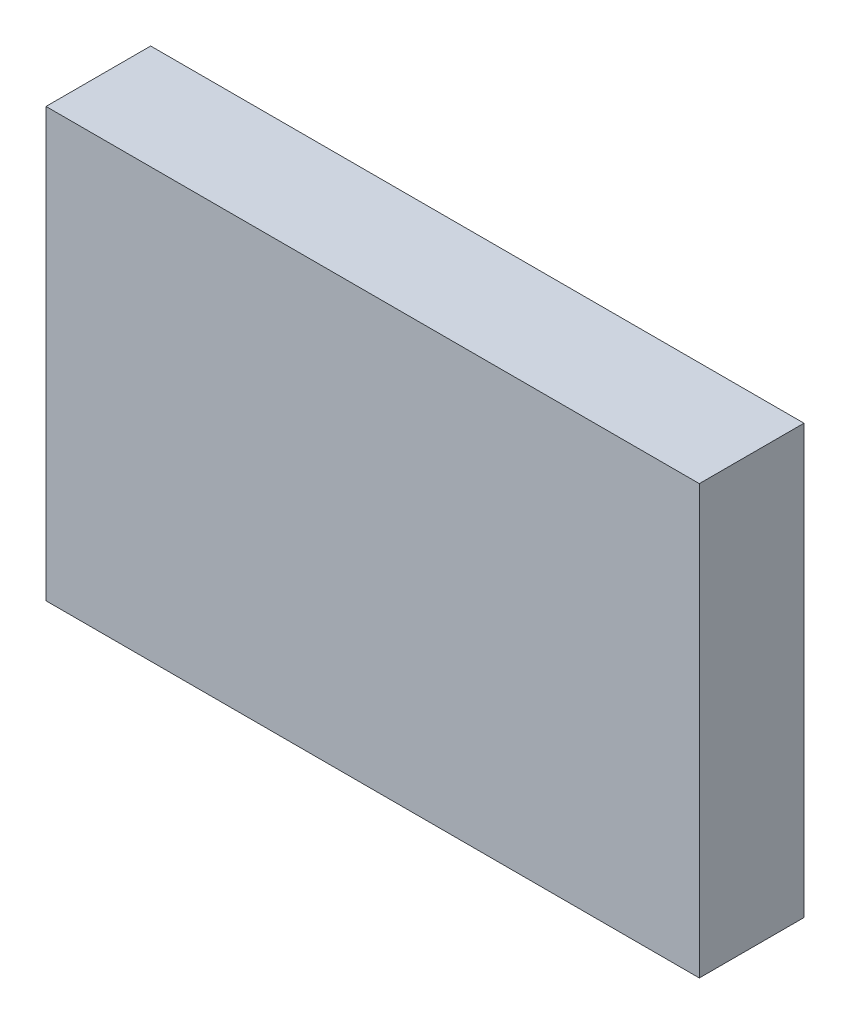
ISO-10303-21;
HEADER;
FILE_DESCRIPTION(('STEP AP214'),'2;1');
FILE_NAME('part.step','',(''),(''),'','','');
FILE_SCHEMA(('AUTOMOTIVE_DESIGN { 1 0 10303 214 1 1 1 1 }'));
ENDSEC;
DATA;
#1=APPLICATION_CONTEXT('core data for automotive mechanical design processes');
#2=APPLICATION_PROTOCOL_DEFINITION('international standard','automotive_design',2000,#1);
#3=PRODUCT_CONTEXT('',#1,'mechanical');
#4=PRODUCT('Part','Part','',(#3));
#5=PRODUCT_RELATED_PRODUCT_CATEGORY('part','',(#4));
#6=PRODUCT_DEFINITION_FORMATION('','',#4);
#7=PRODUCT_DEFINITION_CONTEXT('part definition',#1,'design');
#8=PRODUCT_DEFINITION('design','',#6,#7);
#9=PRODUCT_DEFINITION_SHAPE('','',#8);
#10=(LENGTH_UNIT() NAMED_UNIT(*) SI_UNIT(.MILLI.,.METRE.));
#11=(NAMED_UNIT(*) PLANE_ANGLE_UNIT() SI_UNIT($,.RADIAN.));
#12=(NAMED_UNIT(*) SI_UNIT($,.STERADIAN.) SOLID_ANGLE_UNIT());
#13=UNCERTAINTY_MEASURE_WITH_UNIT(LENGTH_MEASURE(1.E-05),#10,'distance_accuracy_value','');
#14=(GEOMETRIC_REPRESENTATION_CONTEXT(3) GLOBAL_UNCERTAINTY_ASSIGNED_CONTEXT((#13)) GLOBAL_UNIT_ASSIGNED_CONTEXT((#10,
#11,#12)) REPRESENTATION_CONTEXT('',''));
#15=CARTESIAN_POINT('',(0.,0.,0.));
#16=DIRECTION('',(0.,0.,1.));
#17=DIRECTION('',(1.,0.,0.));
#18=AXIS2_PLACEMENT_3D('',#15,#16,#17);
#19=CARTESIAN_POINT('',(103.,67.5,33.));
#20=DIRECTION('',(-1.,0.,0.));
#21=DIRECTION('',(0.,-1.,0.));
#22=AXIS2_PLACEMENT_3D('',#19,#20,#21);
#23=PLANE('',#22);
#24=DIRECTION('',(0.,1.,0.));
#25=VECTOR('',#24,1.);
#26=CARTESIAN_POINT('',(103.,67.5,0.));
#27=LINE('',#26,#25);
#28=CARTESIAN_POINT('',(103.,-67.5,0.));
#29=VERTEX_POINT('',#28);
#30=CARTESIAN_POINT('',(103.,67.5,0.));
#31=VERTEX_POINT('',#30);
#32=EDGE_CURVE('E145',#29,#31,#27,.T.);
#33=ORIENTED_EDGE('',*,*,#32,.T.);
#34=DIRECTION('',(0.,0.,-1.));
#35=VECTOR('',#34,1.);
#36=CARTESIAN_POINT('',(103.,67.5,33.));
#37=LINE('',#36,#35);
#38=CARTESIAN_POINT('',(103.,67.5,33.));
#39=VERTEX_POINT('',#38);
#40=EDGE_CURVE('E11',#39,#31,#37,.T.);
#41=ORIENTED_EDGE('',*,*,#40,.F.);
#42=DIRECTION('',(0.,1.,0.));
#43=VECTOR('',#42,1.);
#44=CARTESIAN_POINT('',(103.,67.5,33.));
#45=LINE('',#44,#43);
#46=CARTESIAN_POINT('',(103.,-67.5,33.));
#47=VERTEX_POINT('',#46);
#48=EDGE_CURVE('E149',#47,#39,#45,.T.);
#49=ORIENTED_EDGE('',*,*,#48,.F.);
#50=DIRECTION('',(0.,0.,-1.));
#51=VECTOR('',#50,1.);
#52=CARTESIAN_POINT('',(103.,-67.5,33.));
#53=LINE('',#52,#51);
#54=EDGE_CURVE('E155',#47,#29,#53,.T.);
#55=ORIENTED_EDGE('',*,*,#54,.T.);
#56=EDGE_LOOP('',(#33,#41,#49,#55));
#57=FACE_BOUND('',#56,.T.);
#58=ADVANCED_FACE('F33',(#57),#23,.F.);
#59=CARTESIAN_POINT('',(-103.,67.5,33.));
#60=DIRECTION('',(0.,-1.,0.));
#61=DIRECTION('',(0.,0.,-1.));
#62=AXIS2_PLACEMENT_3D('',#59,#60,#61);
#63=PLANE('',#62);
#64=DIRECTION('',(-1.,0.,0.));
#65=VECTOR('',#64,1.);
#66=CARTESIAN_POINT('',(-103.,67.5,0.));
#67=LINE('',#66,#65);
#68=CARTESIAN_POINT('',(-103.,67.5,0.));
#69=VERTEX_POINT('',#68);
#70=EDGE_CURVE('E158',#31,#69,#67,.T.);
#71=ORIENTED_EDGE('',*,*,#70,.T.);
#72=DIRECTION('',(0.,0.,-1.));
#73=VECTOR('',#72,1.);
#74=CARTESIAN_POINT('',(-103.,67.5,33.));
#75=LINE('',#74,#73);
#76=CARTESIAN_POINT('',(-103.,67.5,33.));
#77=VERTEX_POINT('',#76);
#78=EDGE_CURVE('E40',#77,#69,#75,.T.);
#79=ORIENTED_EDGE('',*,*,#78,.F.);
#80=DIRECTION('',(-1.,0.,0.));
#81=VECTOR('',#80,1.);
#82=CARTESIAN_POINT('',(-103.,67.5,33.));
#83=LINE('',#82,#81);
#84=EDGE_CURVE('E84',#39,#77,#83,.T.);
#85=ORIENTED_EDGE('',*,*,#84,.F.);
#86=ORIENTED_EDGE('',*,*,#40,.T.);
#87=EDGE_LOOP('',(#71,#79,#85,#86));
#88=FACE_BOUND('',#87,.T.);
#89=ADVANCED_FACE('F186',(#88),#63,.F.);
#90=CARTESIAN_POINT('',(-103.,67.5,33.));
#91=DIRECTION('',(1.,0.,0.));
#92=DIRECTION('',(0.,0.,-1.));
#93=AXIS2_PLACEMENT_3D('',#90,#91,#92);
#94=PLANE('',#93);
#95=CARTESIAN_POINT('',(-103.,19.,16.));
#96=DIRECTION('',(-1.,0.,0.));
#97=DIRECTION('',(0.,0.,1.));
#98=AXIS2_PLACEMENT_3D('',#95,#96,#97);
#99=CIRCLE('',#98,8.5);
#100=CARTESIAN_POINT('',(-103.,19.,24.5));
#101=VERTEX_POINT('',#100);
#102=EDGE_CURVE('E316',#101,#101,#99,.T.);
#103=ORIENTED_EDGE('',*,*,#102,.F.);
#104=EDGE_LOOP('',(#103));
#105=FACE_BOUND('',#104,.T.);
#106=CARTESIAN_POINT('',(-103.,-15.25,16.75));
#107=DIRECTION('',(-1.,0.,0.));
#108=DIRECTION('',(0.,0.,1.));
#109=AXIS2_PLACEMENT_3D('',#106,#107,#108);
#110=CIRCLE('',#109,3.25);
#111=CARTESIAN_POINT('',(-103.,-15.25,20.));
#112=VERTEX_POINT('',#111);
#113=EDGE_CURVE('E132',#112,#112,#110,.T.);
#114=ORIENTED_EDGE('',*,*,#113,.F.);
#115=EDGE_LOOP('',(#114));
#116=FACE_BOUND('',#115,.T.);
#117=DIRECTION('',(0.,0.,1.));
#118=VECTOR('',#117,1.);
#119=CARTESIAN_POINT('',(-103.,-57.5,22.5));
#120=LINE('',#119,#118);
#121=CARTESIAN_POINT('',(-103.,-57.5,7.00000000000001));
#122=VERTEX_POINT('',#121);
#123=CARTESIAN_POINT('',(-103.,-57.5,22.5));
#124=VERTEX_POINT('',#123);
#125=EDGE_CURVE('E138',#122,#124,#120,.T.);
#126=ORIENTED_EDGE('',*,*,#125,.F.);
#127=DIRECTION('',(0.,-1.,0.));
#128=VECTOR('',#127,1.);
#129=CARTESIAN_POINT('',(-103.,-46.,7.));
#130=LINE('',#129,#128);
#131=CARTESIAN_POINT('',(-103.,-46.,7.));
#132=VERTEX_POINT('',#131);
#133=EDGE_CURVE('E47',#132,#122,#130,.T.);
#134=ORIENTED_EDGE('',*,*,#133,.F.);
#135=DIRECTION('',(0.,0.,-1.));
#136=VECTOR('',#135,1.);
#137=CARTESIAN_POINT('',(-103.,-46.,22.5));
#138=LINE('',#137,#136);
#139=CARTESIAN_POINT('',(-103.,-46.,22.5));
#140=VERTEX_POINT('',#139);
#141=EDGE_CURVE('E126',#140,#132,#138,.T.);
#142=ORIENTED_EDGE('',*,*,#141,.F.);
#143=DIRECTION('',(0.,1.,0.));
#144=VECTOR('',#143,1.);
#145=CARTESIAN_POINT('',(-103.,-46.,22.5));
#146=LINE('',#145,#144);
#147=EDGE_CURVE('E129',#124,#140,#146,.T.);
#148=ORIENTED_EDGE('',*,*,#147,.F.);
#149=EDGE_LOOP('',(#126,#134,#142,#148));
#150=FACE_BOUND('',#149,.T.);
#151=DIRECTION('',(0.,-1.,0.));
#152=VECTOR('',#151,1.);
#153=CARTESIAN_POINT('',(-103.,67.5,0.));
#154=LINE('',#153,#152);
#155=CARTESIAN_POINT('',(-103.,-67.5,0.));
#156=VERTEX_POINT('',#155);
#157=EDGE_CURVE('E160',#69,#156,#154,.T.);
#158=ORIENTED_EDGE('',*,*,#157,.T.);
#159=DIRECTION('',(0.,0.,-1.));
#160=VECTOR('',#159,1.);
#161=CARTESIAN_POINT('',(-103.,-67.5,33.));
#162=LINE('',#161,#160);
#163=CARTESIAN_POINT('',(-103.,-67.5,33.));
#164=VERTEX_POINT('',#163);
#165=EDGE_CURVE('E164',#164,#156,#162,.T.);
#166=ORIENTED_EDGE('',*,*,#165,.F.);
#167=DIRECTION('',(0.,-1.,0.));
#168=VECTOR('',#167,1.);
#169=CARTESIAN_POINT('',(-103.,67.5,33.));
#170=LINE('',#169,#168);
#171=EDGE_CURVE('E152',#77,#164,#170,.T.);
#172=ORIENTED_EDGE('',*,*,#171,.F.);
#173=ORIENTED_EDGE('',*,*,#78,.T.);
#174=EDGE_LOOP('',(#158,#166,#172,#173));
#175=FACE_BOUND('',#174,.T.);
#176=ADVANCED_FACE('F169',(#105,#116,#150,#175),#94,.F.);
#177=CARTESIAN_POINT('',(-103.,-67.5,33.));
#178=DIRECTION('',(0.,1.,0.));
#179=DIRECTION('',(0.,0.,1.));
#180=AXIS2_PLACEMENT_3D('',#177,#178,#179);
#181=PLANE('',#180);
#182=DIRECTION('',(1.,0.,0.));
#183=VECTOR('',#182,1.);
#184=CARTESIAN_POINT('',(-103.,-67.5,0.));
#185=LINE('',#184,#183);
#186=EDGE_CURVE('E77',#156,#29,#185,.T.);
#187=ORIENTED_EDGE('',*,*,#186,.T.);
#188=ORIENTED_EDGE('',*,*,#54,.F.);
#189=DIRECTION('',(1.,0.,0.));
#190=VECTOR('',#189,1.);
#191=CARTESIAN_POINT('',(-103.,-67.5,33.));
#192=LINE('',#191,#190);
#193=EDGE_CURVE('E56',#164,#47,#192,.T.);
#194=ORIENTED_EDGE('',*,*,#193,.F.);
#195=ORIENTED_EDGE('',*,*,#165,.T.);
#196=EDGE_LOOP('',(#187,#188,#194,#195));
#197=FACE_BOUND('',#196,.T.);
#198=ADVANCED_FACE('F177',(#197),#181,.F.);
#199=CARTESIAN_POINT('',(0.,0.,33.));
#200=DIRECTION('',(0.,0.,1.));
#201=DIRECTION('',(1.,0.,0.));
#202=AXIS2_PLACEMENT_3D('',#199,#200,#201);
#203=PLANE('',#202);
#204=ORIENTED_EDGE('',*,*,#48,.T.);
#205=ORIENTED_EDGE('',*,*,#84,.T.);
#206=ORIENTED_EDGE('',*,*,#171,.T.);
#207=ORIENTED_EDGE('',*,*,#193,.T.);
#208=EDGE_LOOP('',(#204,#205,#206,#207));
#209=FACE_BOUND('',#208,.T.);
#210=ADVANCED_FACE('F179',(#209),#203,.T.);
#211=CARTESIAN_POINT('',(0.,0.,0.));
#212=DIRECTION('',(0.,0.,1.));
#213=DIRECTION('',(1.,0.,0.));
#214=AXIS2_PLACEMENT_3D('',#211,#212,#213);
#215=PLANE('',#214);
#216=ORIENTED_EDGE('',*,*,#32,.F.);
#217=ORIENTED_EDGE('',*,*,#186,.F.);
#218=ORIENTED_EDGE('',*,*,#157,.F.);
#219=ORIENTED_EDGE('',*,*,#70,.F.);
#220=EDGE_LOOP('',(#216,#217,#218,#219));
#221=FACE_BOUND('',#220,.T.);
#222=ADVANCED_FACE('F173',(#221),#215,.F.);
#223=CARTESIAN_POINT('',(-3.00000000000002,-46.,7.));
#224=DIRECTION('',(0.,0.,-1.));
#225=DIRECTION('',(0.,1.,0.));
#226=AXIS2_PLACEMENT_3D('',#223,#224,#225);
#227=PLANE('',#226);
#228=ORIENTED_EDGE('',*,*,#133,.T.);
#229=DIRECTION('',(-1.,0.,0.));
#230=VECTOR('',#229,1.);
#231=CARTESIAN_POINT('',(-3.00000000000002,-57.5,7.));
#232=LINE('',#231,#230);
#233=CARTESIAN_POINT('',(-3.00000000000002,-57.5,7.));
#234=VERTEX_POINT('',#233);
#235=EDGE_CURVE('E104',#234,#122,#232,.T.);
#236=ORIENTED_EDGE('',*,*,#235,.F.);
#237=DIRECTION('',(0.,-1.,0.));
#238=VECTOR('',#237,1.);
#239=CARTESIAN_POINT('',(-3.00000000000002,-46.,7.));
#240=LINE('',#239,#238);
#241=CARTESIAN_POINT('',(-3.00000000000002,-46.,7.));
#242=VERTEX_POINT('',#241);
#243=EDGE_CURVE('E108',#242,#234,#240,.T.);
#244=ORIENTED_EDGE('',*,*,#243,.F.);
#245=DIRECTION('',(-1.,0.,0.));
#246=VECTOR('',#245,1.);
#247=CARTESIAN_POINT('',(-3.00000000000002,-46.,7.));
#248=LINE('',#247,#246);
#249=EDGE_CURVE('E143',#242,#132,#248,.T.);
#250=ORIENTED_EDGE('',*,*,#249,.T.);
#251=EDGE_LOOP('',(#228,#236,#244,#250));
#252=FACE_BOUND('',#251,.T.);
#253=ADVANCED_FACE('F106',(#252),#227,.F.);
#254=CARTESIAN_POINT('',(-3.00000000000002,-46.,22.5));
#255=DIRECTION('',(0.,1.,0.));
#256=DIRECTION('',(0.,0.,1.));
#257=AXIS2_PLACEMENT_3D('',#254,#255,#256);
#258=PLANE('',#257);
#259=ORIENTED_EDGE('',*,*,#141,.T.);
#260=ORIENTED_EDGE('',*,*,#249,.F.);
#261=DIRECTION('',(0.,0.,-1.));
#262=VECTOR('',#261,1.);
#263=CARTESIAN_POINT('',(-3.00000000000002,-46.,22.5));
#264=LINE('',#263,#262);
#265=CARTESIAN_POINT('',(-3.00000000000002,-46.,22.5));
#266=VERTEX_POINT('',#265);
#267=EDGE_CURVE('E114',#266,#242,#264,.T.);
#268=ORIENTED_EDGE('',*,*,#267,.F.);
#269=DIRECTION('',(-1.,0.,0.));
#270=VECTOR('',#269,1.);
#271=CARTESIAN_POINT('',(-3.00000000000002,-46.,22.5));
#272=LINE('',#271,#270);
#273=EDGE_CURVE('E146',#266,#140,#272,.T.);
#274=ORIENTED_EDGE('',*,*,#273,.T.);
#275=EDGE_LOOP('',(#259,#260,#268,#274));
#276=FACE_BOUND('',#275,.T.);
#277=ADVANCED_FACE('F241',(#276),#258,.F.);
#278=CARTESIAN_POINT('',(-3.00000000000002,-46.,22.5));
#279=DIRECTION('',(0.,0.,1.));
#280=DIRECTION('',(1.,0.,0.));
#281=AXIS2_PLACEMENT_3D('',#278,#279,#280);
#282=PLANE('',#281);
#283=ORIENTED_EDGE('',*,*,#147,.T.);
#284=ORIENTED_EDGE('',*,*,#273,.F.);
#285=DIRECTION('',(0.,1.,0.));
#286=VECTOR('',#285,1.);
#287=CARTESIAN_POINT('',(-3.00000000000002,-46.,22.5));
#288=LINE('',#287,#286);
#289=CARTESIAN_POINT('',(-3.00000000000002,-57.5,22.5));
#290=VERTEX_POINT('',#289);
#291=EDGE_CURVE('E122',#290,#266,#288,.T.);
#292=ORIENTED_EDGE('',*,*,#291,.F.);
#293=DIRECTION('',(-1.,0.,0.));
#294=VECTOR('',#293,1.);
#295=CARTESIAN_POINT('',(-3.00000000000002,-57.5,22.5));
#296=LINE('',#295,#294);
#297=EDGE_CURVE('E113',#290,#124,#296,.T.);
#298=ORIENTED_EDGE('',*,*,#297,.T.);
#299=EDGE_LOOP('',(#283,#284,#292,#298));
#300=FACE_BOUND('',#299,.T.);
#301=ADVANCED_FACE('F244',(#300),#282,.F.);
#302=CARTESIAN_POINT('',(-3.00000000000002,-57.5,22.5));
#303=DIRECTION('',(0.,-1.,0.));
#304=DIRECTION('',(0.,0.,-1.));
#305=AXIS2_PLACEMENT_3D('',#302,#303,#304);
#306=PLANE('',#305);
#307=ORIENTED_EDGE('',*,*,#125,.T.);
#308=ORIENTED_EDGE('',*,*,#297,.F.);
#309=DIRECTION('',(0.,0.,1.));
#310=VECTOR('',#309,1.);
#311=CARTESIAN_POINT('',(-3.00000000000002,-57.5,22.5));
#312=LINE('',#311,#310);
#313=EDGE_CURVE('E117',#234,#290,#312,.T.);
#314=ORIENTED_EDGE('',*,*,#313,.F.);
#315=ORIENTED_EDGE('',*,*,#235,.T.);
#316=EDGE_LOOP('',(#307,#308,#314,#315));
#317=FACE_BOUND('',#316,.T.);
#318=ADVANCED_FACE('F118',(#317),#306,.F.);
#319=CARTESIAN_POINT('',(-3.00000000000002,0.,0.));
#320=DIRECTION('',(1.,0.,0.));
#321=DIRECTION('',(0.,0.,-1.));
#322=AXIS2_PLACEMENT_3D('',#319,#320,#321);
#323=PLANE('',#322);
#324=ORIENTED_EDGE('',*,*,#243,.T.);
#325=ORIENTED_EDGE('',*,*,#313,.T.);
#326=ORIENTED_EDGE('',*,*,#291,.T.);
#327=ORIENTED_EDGE('',*,*,#267,.T.);
#328=EDGE_LOOP('',(#324,#325,#326,#327));
#329=FACE_BOUND('',#328,.T.);
#330=ADVANCED_FACE('F124',(#329),#323,.F.);
#331=CARTESIAN_POINT('',(-3.00000000000002,-15.25,16.75));
#332=DIRECTION('',(-1.,0.,0.));
#333=DIRECTION('',(0.,0.,1.));
#334=AXIS2_PLACEMENT_3D('',#331,#332,#333);
#335=CYLINDRICAL_SURFACE('',#334,3.25);
#336=CARTESIAN_POINT('',(-3.00000000000002,-15.25,16.75));
#337=DIRECTION('',(-1.,0.,0.));
#338=DIRECTION('',(0.,0.,1.));
#339=AXIS2_PLACEMENT_3D('',#336,#337,#338);
#340=CIRCLE('',#339,3.25);
#341=CARTESIAN_POINT('',(-3.00000000000002,-15.25,20.));
#342=VERTEX_POINT('',#341);
#343=EDGE_CURVE('E139',#342,#342,#340,.T.);
#344=ORIENTED_EDGE('',*,*,#343,.F.);
#345=EDGE_LOOP('',(#344));
#346=FACE_BOUND('',#345,.T.);
#347=ORIENTED_EDGE('',*,*,#113,.T.);
#348=EDGE_LOOP('',(#347));
#349=FACE_BOUND('',#348,.T.);
#350=ADVANCED_FACE('F234',(#346,#349),#335,.F.);
#351=CARTESIAN_POINT('',(-3.00000000000002,-15.25,16.75));
#352=DIRECTION('',(-1.,0.,0.));
#353=DIRECTION('',(0.,0.,1.));
#354=AXIS2_PLACEMENT_3D('',#351,#352,#353);
#355=PLANE('',#354);
#356=ORIENTED_EDGE('',*,*,#343,.T.);
#357=EDGE_LOOP('',(#356));
#358=FACE_BOUND('',#357,.T.);
#359=ADVANCED_FACE('F207',(#358),#355,.T.);
#360=CARTESIAN_POINT('',(-3.00000000000002,19.,16.));
#361=DIRECTION('',(-1.,0.,0.));
#362=DIRECTION('',(0.,0.,1.));
#363=AXIS2_PLACEMENT_3D('',#360,#361,#362);
#364=CYLINDRICAL_SURFACE('',#363,8.5);
#365=CARTESIAN_POINT('',(-3.00000000000002,19.,16.));
#366=DIRECTION('',(-1.,0.,0.));
#367=DIRECTION('',(0.,0.,1.));
#368=AXIS2_PLACEMENT_3D('',#365,#366,#367);
#369=CIRCLE('',#368,8.5);
#370=CARTESIAN_POINT('',(-3.00000000000002,19.,24.5));
#371=VERTEX_POINT('',#370);
#372=EDGE_CURVE('E315',#371,#371,#369,.T.);
#373=ORIENTED_EDGE('',*,*,#372,.F.);
#374=EDGE_LOOP('',(#373));
#375=FACE_BOUND('',#374,.T.);
#376=ORIENTED_EDGE('',*,*,#102,.T.);
#377=EDGE_LOOP('',(#376));
#378=FACE_BOUND('',#377,.T.);
#379=ADVANCED_FACE('F212',(#375,#378),#364,.F.);
#380=CARTESIAN_POINT('',(-3.00000000000002,19.,16.));
#381=DIRECTION('',(-1.,0.,0.));
#382=DIRECTION('',(0.,0.,1.));
#383=AXIS2_PLACEMENT_3D('',#380,#381,#382);
#384=PLANE('',#383);
#385=ORIENTED_EDGE('',*,*,#372,.T.);
#386=EDGE_LOOP('',(#385));
#387=FACE_BOUND('',#386,.T.);
#388=ADVANCED_FACE('F217',(#387),#384,.T.);
#389=CLOSED_SHELL('',(#58,#89,#176,#198,#210,#222,#253,#277,#301,#318,#330,#350,#359,#379,#388));
#390=MANIFOLD_SOLID_BREP('B2',#389);
#391=ADVANCED_BREP_SHAPE_REPRESENTATION('',(#18,#390),#14);
#392=SHAPE_DEFINITION_REPRESENTATION(#9,#391);
ENDSEC;
END-ISO-10303-21;
